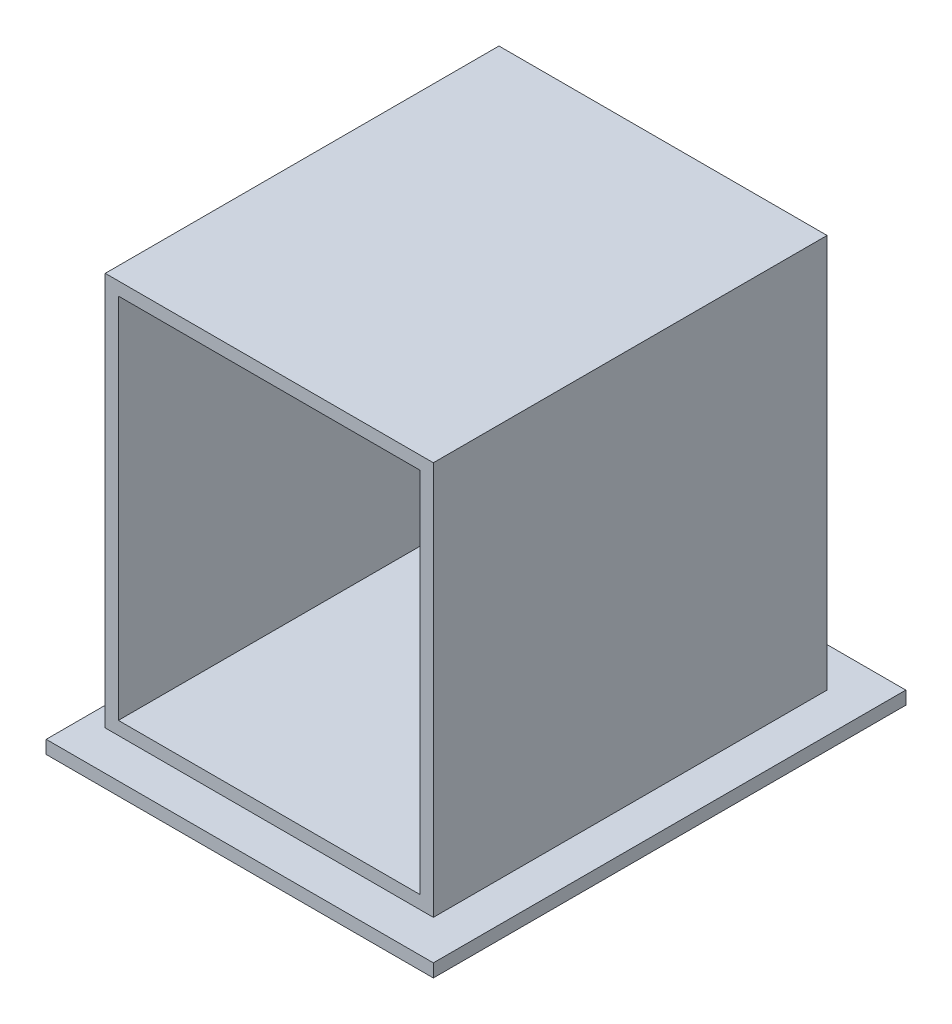
ISO-10303-21;
HEADER;
FILE_DESCRIPTION(('STEP AP214'),'2;1');
FILE_NAME('part.step','',(''),(''),'','','');
FILE_SCHEMA(('AUTOMOTIVE_DESIGN { 1 0 10303 214 1 1 1 1 }'));
ENDSEC;
DATA;
#1=APPLICATION_CONTEXT('core data for automotive mechanical design processes');
#2=APPLICATION_PROTOCOL_DEFINITION('international standard','automotive_design',2000,#1);
#3=PRODUCT_CONTEXT('',#1,'mechanical');
#4=PRODUCT('Part','Part','',(#3));
#5=PRODUCT_RELATED_PRODUCT_CATEGORY('part','',(#4));
#6=PRODUCT_DEFINITION_FORMATION('','',#4);
#7=PRODUCT_DEFINITION_CONTEXT('part definition',#1,'design');
#8=PRODUCT_DEFINITION('design','',#6,#7);
#9=PRODUCT_DEFINITION_SHAPE('','',#8);
#10=(LENGTH_UNIT() NAMED_UNIT(*) SI_UNIT(.MILLI.,.METRE.));
#11=(NAMED_UNIT(*) PLANE_ANGLE_UNIT() SI_UNIT($,.RADIAN.));
#12=(NAMED_UNIT(*) SI_UNIT($,.STERADIAN.) SOLID_ANGLE_UNIT());
#13=UNCERTAINTY_MEASURE_WITH_UNIT(LENGTH_MEASURE(1.E-05),#10,'distance_accuracy_value','');
#14=(GEOMETRIC_REPRESENTATION_CONTEXT(3) GLOBAL_UNCERTAINTY_ASSIGNED_CONTEXT((#13)) GLOBAL_UNIT_ASSIGNED_CONTEXT((#10,
#11,#12)) REPRESENTATION_CONTEXT('',''));
#15=CARTESIAN_POINT('',(0.,0.,0.));
#16=DIRECTION('',(0.,0.,1.));
#17=DIRECTION('',(1.,0.,0.));
#18=AXIS2_PLACEMENT_3D('',#15,#16,#17);
#19=CARTESIAN_POINT('',(0.,0.,300.));
#20=DIRECTION('',(1.,0.,0.));
#21=DIRECTION('',(0.,0.,-1.));
#22=AXIS2_PLACEMENT_3D('',#19,#20,#21);
#23=PLANE('',#22);
#24=DIRECTION('',(0.,-1.,0.));
#25=VECTOR('',#24,1.);
#26=CARTESIAN_POINT('',(0.,0.,0.));
#27=LINE('',#26,#25);
#28=CARTESIAN_POINT('',(0.,300.,0.));
#29=VERTEX_POINT('',#28);
#30=CARTESIAN_POINT('',(0.,0.,0.));
#31=VERTEX_POINT('',#30);
#32=EDGE_CURVE('E238',#29,#31,#27,.T.);
#33=ORIENTED_EDGE('',*,*,#32,.T.);
#34=DIRECTION('',(0.,0.,-1.));
#35=VECTOR('',#34,1.);
#36=CARTESIAN_POINT('',(0.,0.,300.));
#37=LINE('',#36,#35);
#38=CARTESIAN_POINT('',(0.,0.,300.));
#39=VERTEX_POINT('',#38);
#40=EDGE_CURVE('E11',#39,#31,#37,.T.);
#41=ORIENTED_EDGE('',*,*,#40,.F.);
#42=DIRECTION('',(0.,-1.,0.));
#43=VECTOR('',#42,1.);
#44=CARTESIAN_POINT('',(0.,0.,300.));
#45=LINE('',#44,#43);
#46=CARTESIAN_POINT('',(0.,300.,300.));
#47=VERTEX_POINT('',#46);
#48=EDGE_CURVE('E244',#47,#39,#45,.T.);
#49=ORIENTED_EDGE('',*,*,#48,.F.);
#50=DIRECTION('',(0.,0.,-1.));
#51=VECTOR('',#50,1.);
#52=CARTESIAN_POINT('',(0.,300.,300.));
#53=LINE('',#52,#51);
#54=EDGE_CURVE('E253',#47,#29,#53,.T.);
#55=ORIENTED_EDGE('',*,*,#54,.T.);
#56=EDGE_LOOP('',(#33,#41,#49,#55));
#57=FACE_BOUND('',#56,.T.);
#58=ADVANCED_FACE('F33',(#57),#23,.F.);
#59=CARTESIAN_POINT('',(250.,0.,300.));
#60=DIRECTION('',(-1.,0.,0.));
#61=DIRECTION('',(0.,-1.,0.));
#62=AXIS2_PLACEMENT_3D('',#59,#60,#61);
#63=PLANE('',#62);
#64=DIRECTION('',(0.,1.,0.));
#65=VECTOR('',#64,1.);
#66=CARTESIAN_POINT('',(250.,0.,0.));
#67=LINE('',#66,#65);
#68=CARTESIAN_POINT('',(250.,0.,0.));
#69=VERTEX_POINT('',#68);
#70=CARTESIAN_POINT('',(250.,300.,0.));
#71=VERTEX_POINT('',#70);
#72=EDGE_CURVE('E258',#69,#71,#67,.T.);
#73=ORIENTED_EDGE('',*,*,#72,.T.);
#74=DIRECTION('',(0.,0.,-1.));
#75=VECTOR('',#74,1.);
#76=CARTESIAN_POINT('',(250.,300.,300.));
#77=LINE('',#76,#75);
#78=CARTESIAN_POINT('',(250.,300.,300.));
#79=VERTEX_POINT('',#78);
#80=EDGE_CURVE('E263',#79,#71,#77,.T.);
#81=ORIENTED_EDGE('',*,*,#80,.F.);
#82=DIRECTION('',(0.,1.,0.));
#83=VECTOR('',#82,1.);
#84=CARTESIAN_POINT('',(250.,0.,300.));
#85=LINE('',#84,#83);
#86=CARTESIAN_POINT('',(250.,0.,300.));
#87=VERTEX_POINT('',#86);
#88=EDGE_CURVE('E249',#87,#79,#85,.T.);
#89=ORIENTED_EDGE('',*,*,#88,.F.);
#90=DIRECTION('',(0.,0.,-1.));
#91=VECTOR('',#90,1.);
#92=CARTESIAN_POINT('',(250.,0.,300.));
#93=LINE('',#92,#91);
#94=EDGE_CURVE('E40',#87,#69,#93,.T.);
#95=ORIENTED_EDGE('',*,*,#94,.T.);
#96=EDGE_LOOP('',(#73,#81,#89,#95));
#97=FACE_BOUND('',#96,.T.);
#98=ADVANCED_FACE('F269',(#97),#63,.F.);
#99=CARTESIAN_POINT('',(0.,300.,300.));
#100=DIRECTION('',(0.,-1.,0.));
#101=DIRECTION('',(0.,0.,-1.));
#102=AXIS2_PLACEMENT_3D('',#99,#100,#101);
#103=PLANE('',#102);
#104=DIRECTION('',(-1.,0.,0.));
#105=VECTOR('',#104,1.);
#106=CARTESIAN_POINT('',(0.,300.,0.));
#107=LINE('',#106,#105);
#108=EDGE_CURVE('E247',#71,#29,#107,.T.);
#109=ORIENTED_EDGE('',*,*,#108,.T.);
#110=ORIENTED_EDGE('',*,*,#54,.F.);
#111=DIRECTION('',(-1.,0.,0.));
#112=VECTOR('',#111,1.);
#113=CARTESIAN_POINT('',(0.,300.,300.));
#114=LINE('',#113,#112);
#115=EDGE_CURVE('E251',#79,#47,#114,.T.);
#116=ORIENTED_EDGE('',*,*,#115,.F.);
#117=ORIENTED_EDGE('',*,*,#80,.T.);
#118=EDGE_LOOP('',(#109,#110,#116,#117));
#119=FACE_BOUND('',#118,.T.);
#120=ADVANCED_FACE('F285',(#119),#103,.F.);
#121=CARTESIAN_POINT('',(0.,0.,300.));
#122=DIRECTION('',(0.,0.,-1.));
#123=DIRECTION('',(-1.,0.,0.));
#124=AXIS2_PLACEMENT_3D('',#121,#122,#123);
#125=PLANE('',#124);
#126=DIRECTION('',(1.,0.,0.));
#127=VECTOR('',#126,1.);
#128=CARTESIAN_POINT('',(10.,10.,300.));
#129=LINE('',#128,#127);
#130=CARTESIAN_POINT('',(10.,10.,300.));
#131=VERTEX_POINT('',#130);
#132=CARTESIAN_POINT('',(240.,10.,300.));
#133=VERTEX_POINT('',#132);
#134=EDGE_CURVE('E228',#131,#133,#129,.T.);
#135=ORIENTED_EDGE('',*,*,#134,.F.);
#136=DIRECTION('',(0.,-1.,0.));
#137=VECTOR('',#136,1.);
#138=CARTESIAN_POINT('',(10.,10.,300.));
#139=LINE('',#138,#137);
#140=CARTESIAN_POINT('',(10.,290.,300.));
#141=VERTEX_POINT('',#140);
#142=EDGE_CURVE('E55',#141,#131,#139,.T.);
#143=ORIENTED_EDGE('',*,*,#142,.F.);
#144=DIRECTION('',(-1.,0.,0.));
#145=VECTOR('',#144,1.);
#146=CARTESIAN_POINT('',(10.,290.,300.));
#147=LINE('',#146,#145);
#148=CARTESIAN_POINT('',(240.,290.,300.));
#149=VERTEX_POINT('',#148);
#150=EDGE_CURVE('E217',#149,#141,#147,.T.);
#151=ORIENTED_EDGE('',*,*,#150,.F.);
#152=DIRECTION('',(0.,1.,0.));
#153=VECTOR('',#152,1.);
#154=CARTESIAN_POINT('',(240.,10.,300.));
#155=LINE('',#154,#153);
#156=EDGE_CURVE('E231',#133,#149,#155,.T.);
#157=ORIENTED_EDGE('',*,*,#156,.F.);
#158=EDGE_LOOP('',(#135,#143,#151,#157));
#159=FACE_BOUND('',#158,.T.);
#160=ORIENTED_EDGE('',*,*,#48,.T.);
#161=DIRECTION('',(1.,0.,0.));
#162=VECTOR('',#161,1.);
#163=CARTESIAN_POINT('',(0.,0.,300.));
#164=LINE('',#163,#162);
#165=EDGE_CURVE('E246',#39,#87,#164,.T.);
#166=ORIENTED_EDGE('',*,*,#165,.T.);
#167=ORIENTED_EDGE('',*,*,#88,.T.);
#168=ORIENTED_EDGE('',*,*,#115,.T.);
#169=EDGE_LOOP('',(#160,#166,#167,#168));
#170=FACE_BOUND('',#169,.T.);
#171=ADVANCED_FACE('F287',(#159,#170),#125,.F.);
#172=CARTESIAN_POINT('',(0.,0.,0.));
#173=DIRECTION('',(0.,0.,-1.));
#174=DIRECTION('',(-1.,0.,0.));
#175=AXIS2_PLACEMENT_3D('',#172,#173,#174);
#176=PLANE('',#175);
#177=ORIENTED_EDGE('',*,*,#32,.F.);
#178=ORIENTED_EDGE('',*,*,#108,.F.);
#179=ORIENTED_EDGE('',*,*,#72,.F.);
#180=DIRECTION('',(1.,0.,0.));
#181=VECTOR('',#180,1.);
#182=CARTESIAN_POINT('',(0.,0.,0.));
#183=LINE('',#182,#181);
#184=EDGE_CURVE('E255',#31,#69,#183,.T.);
#185=ORIENTED_EDGE('',*,*,#184,.F.);
#186=EDGE_LOOP('',(#177,#178,#179,#185));
#187=FACE_BOUND('',#186,.T.);
#188=ADVANCED_FACE('F277',(#187),#176,.T.);
#189=CARTESIAN_POINT('',(10.,10.,10.));
#190=DIRECTION('',(-1.,0.,0.));
#191=DIRECTION('',(0.,-1.,0.));
#192=AXIS2_PLACEMENT_3D('',#189,#190,#191);
#193=PLANE('',#192);
#194=ORIENTED_EDGE('',*,*,#142,.T.);
#195=DIRECTION('',(0.,0.,1.));
#196=VECTOR('',#195,1.);
#197=CARTESIAN_POINT('',(10.,10.,10.));
#198=LINE('',#197,#196);
#199=CARTESIAN_POINT('',(10.,10.,10.));
#200=VERTEX_POINT('',#199);
#201=EDGE_CURVE('E226',#200,#131,#198,.T.);
#202=ORIENTED_EDGE('',*,*,#201,.F.);
#203=DIRECTION('',(0.,-1.,0.));
#204=VECTOR('',#203,1.);
#205=CARTESIAN_POINT('',(10.,10.,10.));
#206=LINE('',#205,#204);
#207=CARTESIAN_POINT('',(10.,290.,10.));
#208=VERTEX_POINT('',#207);
#209=EDGE_CURVE('E213',#208,#200,#206,.T.);
#210=ORIENTED_EDGE('',*,*,#209,.F.);
#211=DIRECTION('',(0.,0.,1.));
#212=VECTOR('',#211,1.);
#213=CARTESIAN_POINT('',(10.,290.,10.));
#214=LINE('',#213,#212);
#215=EDGE_CURVE('E236',#208,#141,#214,.T.);
#216=ORIENTED_EDGE('',*,*,#215,.T.);
#217=EDGE_LOOP('',(#194,#202,#210,#216));
#218=FACE_BOUND('',#217,.T.);
#219=ADVANCED_FACE('F295',(#218),#193,.F.);
#220=CARTESIAN_POINT('',(10.,290.,10.));
#221=DIRECTION('',(0.,1.,0.));
#222=DIRECTION('',(0.,0.,1.));
#223=AXIS2_PLACEMENT_3D('',#220,#221,#222);
#224=PLANE('',#223);
#225=ORIENTED_EDGE('',*,*,#150,.T.);
#226=ORIENTED_EDGE('',*,*,#215,.F.);
#227=DIRECTION('',(-1.,0.,0.));
#228=VECTOR('',#227,1.);
#229=CARTESIAN_POINT('',(10.,290.,10.));
#230=LINE('',#229,#228);
#231=CARTESIAN_POINT('',(240.,290.,10.));
#232=VERTEX_POINT('',#231);
#233=EDGE_CURVE('E223',#232,#208,#230,.T.);
#234=ORIENTED_EDGE('',*,*,#233,.F.);
#235=DIRECTION('',(0.,0.,1.));
#236=VECTOR('',#235,1.);
#237=CARTESIAN_POINT('',(240.,290.,10.));
#238=LINE('',#237,#236);
#239=EDGE_CURVE('E239',#232,#149,#238,.T.);
#240=ORIENTED_EDGE('',*,*,#239,.T.);
#241=EDGE_LOOP('',(#225,#226,#234,#240));
#242=FACE_BOUND('',#241,.T.);
#243=ADVANCED_FACE('F333',(#242),#224,.F.);
#244=CARTESIAN_POINT('',(240.,10.,10.));
#245=DIRECTION('',(1.,0.,0.));
#246=DIRECTION('',(0.,0.,-1.));
#247=AXIS2_PLACEMENT_3D('',#244,#245,#246);
#248=PLANE('',#247);
#249=ORIENTED_EDGE('',*,*,#156,.T.);
#250=ORIENTED_EDGE('',*,*,#239,.F.);
#251=DIRECTION('',(0.,1.,0.));
#252=VECTOR('',#251,1.);
#253=CARTESIAN_POINT('',(240.,10.,10.));
#254=LINE('',#253,#252);
#255=CARTESIAN_POINT('',(240.,10.,10.));
#256=VERTEX_POINT('',#255);
#257=EDGE_CURVE('E220',#256,#232,#254,.T.);
#258=ORIENTED_EDGE('',*,*,#257,.F.);
#259=DIRECTION('',(0.,0.,1.));
#260=VECTOR('',#259,1.);
#261=CARTESIAN_POINT('',(240.,10.,10.));
#262=LINE('',#261,#260);
#263=EDGE_CURVE('E241',#256,#133,#262,.T.);
#264=ORIENTED_EDGE('',*,*,#263,.T.);
#265=EDGE_LOOP('',(#249,#250,#258,#264));
#266=FACE_BOUND('',#265,.T.);
#267=ADVANCED_FACE('F338',(#266),#248,.F.);
#268=CARTESIAN_POINT('',(10.,10.,10.));
#269=DIRECTION('',(0.,-1.,0.));
#270=DIRECTION('',(0.,0.,-1.));
#271=AXIS2_PLACEMENT_3D('',#268,#269,#270);
#272=PLANE('',#271);
#273=ORIENTED_EDGE('',*,*,#134,.T.);
#274=ORIENTED_EDGE('',*,*,#263,.F.);
#275=DIRECTION('',(1.,0.,0.));
#276=VECTOR('',#275,1.);
#277=CARTESIAN_POINT('',(10.,10.,10.));
#278=LINE('',#277,#276);
#279=EDGE_CURVE('E216',#200,#256,#278,.T.);
#280=ORIENTED_EDGE('',*,*,#279,.F.);
#281=ORIENTED_EDGE('',*,*,#201,.T.);
#282=EDGE_LOOP('',(#273,#274,#280,#281));
#283=FACE_BOUND('',#282,.T.);
#284=ADVANCED_FACE('F346',(#283),#272,.F.);
#285=CARTESIAN_POINT('',(0.,0.,10.));
#286=DIRECTION('',(0.,0.,-1.));
#287=DIRECTION('',(-1.,0.,0.));
#288=AXIS2_PLACEMENT_3D('',#285,#286,#287);
#289=PLANE('',#288);
#290=ORIENTED_EDGE('',*,*,#209,.T.);
#291=ORIENTED_EDGE('',*,*,#279,.T.);
#292=ORIENTED_EDGE('',*,*,#257,.T.);
#293=ORIENTED_EDGE('',*,*,#233,.T.);
#294=EDGE_LOOP('',(#290,#291,#292,#293));
#295=FACE_BOUND('',#294,.T.);
#296=ADVANCED_FACE('F354',(#295),#289,.F.);
#297=CARTESIAN_POINT('',(0.,0.,0.));
#298=DIRECTION('',(0.,-1.,0.));
#299=DIRECTION('',(0.,0.,-1.));
#300=AXIS2_PLACEMENT_3D('',#297,#298,#299);
#301=PLANE('',#300);
#302=DIRECTION('',(0.,0.,-1.));
#303=VECTOR('',#302,1.);
#304=CARTESIAN_POINT('',(-15.,0.,330.));
#305=LINE('',#304,#303);
#306=CARTESIAN_POINT('',(-15.,0.,330.));
#307=VERTEX_POINT('',#306);
#308=CARTESIAN_POINT('',(-15.,0.,-30.));
#309=VERTEX_POINT('',#308);
#310=EDGE_CURVE('E180',#307,#309,#305,.T.);
#311=ORIENTED_EDGE('',*,*,#310,.F.);
#312=DIRECTION('',(-1.,0.,0.));
#313=VECTOR('',#312,1.);
#314=CARTESIAN_POINT('',(-15.,0.,330.));
#315=LINE('',#314,#313);
#316=CARTESIAN_POINT('',(280.,0.,330.));
#317=VERTEX_POINT('',#316);
#318=EDGE_CURVE('E188',#317,#307,#315,.T.);
#319=ORIENTED_EDGE('',*,*,#318,.F.);
#320=DIRECTION('',(0.,0.,1.));
#321=VECTOR('',#320,1.);
#322=CARTESIAN_POINT('',(280.,0.,330.));
#323=LINE('',#322,#321);
#324=CARTESIAN_POINT('',(280.,0.,-30.));
#325=VERTEX_POINT('',#324);
#326=EDGE_CURVE('E199',#325,#317,#323,.T.);
#327=ORIENTED_EDGE('',*,*,#326,.F.);
#328=DIRECTION('',(1.,0.,0.));
#329=VECTOR('',#328,1.);
#330=CARTESIAN_POINT('',(-15.,0.,-30.));
#331=LINE('',#330,#329);
#332=EDGE_CURVE('E197',#309,#325,#331,.T.);
#333=ORIENTED_EDGE('',*,*,#332,.F.);
#334=EDGE_LOOP('',(#311,#319,#327,#333));
#335=FACE_BOUND('',#334,.T.);
#336=ORIENTED_EDGE('',*,*,#40,.T.);
#337=ORIENTED_EDGE('',*,*,#184,.T.);
#338=ORIENTED_EDGE('',*,*,#94,.F.);
#339=ORIENTED_EDGE('',*,*,#165,.F.);
#340=EDGE_LOOP('',(#336,#337,#338,#339));
#341=FACE_BOUND('',#340,.T.);
#342=ADVANCED_FACE('F278',(#335,#341),#301,.F.);
#343=CARTESIAN_POINT('',(-15.,-10.,330.));
#344=DIRECTION('',(1.,0.,0.));
#345=DIRECTION('',(0.,0.,-1.));
#346=AXIS2_PLACEMENT_3D('',#343,#344,#345);
#347=PLANE('',#346);
#348=ORIENTED_EDGE('',*,*,#310,.T.);
#349=DIRECTION('',(0.,1.,0.));
#350=VECTOR('',#349,1.);
#351=CARTESIAN_POINT('',(-15.,-10.,-30.));
#352=LINE('',#351,#350);
#353=CARTESIAN_POINT('',(-15.,-10.,-30.));
#354=VERTEX_POINT('',#353);
#355=EDGE_CURVE('E210',#354,#309,#352,.T.);
#356=ORIENTED_EDGE('',*,*,#355,.F.);
#357=DIRECTION('',(0.,0.,-1.));
#358=VECTOR('',#357,1.);
#359=CARTESIAN_POINT('',(-15.,-10.,330.));
#360=LINE('',#359,#358);
#361=CARTESIAN_POINT('',(-15.,-10.,330.));
#362=VERTEX_POINT('',#361);
#363=EDGE_CURVE('E184',#362,#354,#360,.T.);
#364=ORIENTED_EDGE('',*,*,#363,.F.);
#365=DIRECTION('',(0.,1.,0.));
#366=VECTOR('',#365,1.);
#367=CARTESIAN_POINT('',(-15.,-10.,330.));
#368=LINE('',#367,#366);
#369=EDGE_CURVE('E194',#362,#307,#368,.T.);
#370=ORIENTED_EDGE('',*,*,#369,.T.);
#371=EDGE_LOOP('',(#348,#356,#364,#370));
#372=FACE_BOUND('',#371,.T.);
#373=ADVANCED_FACE('F367',(#372),#347,.F.);
#374=CARTESIAN_POINT('',(-15.,-10.,-30.));
#375=DIRECTION('',(0.,0.,1.));
#376=DIRECTION('',(1.,0.,0.));
#377=AXIS2_PLACEMENT_3D('',#374,#375,#376);
#378=PLANE('',#377);
#379=ORIENTED_EDGE('',*,*,#332,.T.);
#380=DIRECTION('',(0.,1.,0.));
#381=VECTOR('',#380,1.);
#382=CARTESIAN_POINT('',(280.,-10.,-30.));
#383=LINE('',#382,#381);
#384=CARTESIAN_POINT('',(280.,-10.,-30.));
#385=VERTEX_POINT('',#384);
#386=EDGE_CURVE('E207',#385,#325,#383,.T.);
#387=ORIENTED_EDGE('',*,*,#386,.F.);
#388=DIRECTION('',(1.,0.,0.));
#389=VECTOR('',#388,1.);
#390=CARTESIAN_POINT('',(-15.,-10.,-30.));
#391=LINE('',#390,#389);
#392=EDGE_CURVE('E187',#354,#385,#391,.T.);
#393=ORIENTED_EDGE('',*,*,#392,.F.);
#394=ORIENTED_EDGE('',*,*,#355,.T.);
#395=EDGE_LOOP('',(#379,#387,#393,#394));
#396=FACE_BOUND('',#395,.T.);
#397=ADVANCED_FACE('F375',(#396),#378,.F.);
#398=CARTESIAN_POINT('',(280.,-10.,330.));
#399=DIRECTION('',(-1.,0.,0.));
#400=DIRECTION('',(0.,0.,1.));
#401=AXIS2_PLACEMENT_3D('',#398,#399,#400);
#402=PLANE('',#401);
#403=ORIENTED_EDGE('',*,*,#326,.T.);
#404=DIRECTION('',(0.,1.,0.));
#405=VECTOR('',#404,1.);
#406=CARTESIAN_POINT('',(280.,-10.,330.));
#407=LINE('',#406,#405);
#408=CARTESIAN_POINT('',(280.,-10.,330.));
#409=VERTEX_POINT('',#408);
#410=EDGE_CURVE('E204',#409,#317,#407,.T.);
#411=ORIENTED_EDGE('',*,*,#410,.F.);
#412=DIRECTION('',(0.,0.,1.));
#413=VECTOR('',#412,1.);
#414=CARTESIAN_POINT('',(280.,-10.,330.));
#415=LINE('',#414,#413);
#416=EDGE_CURVE('E190',#385,#409,#415,.T.);
#417=ORIENTED_EDGE('',*,*,#416,.F.);
#418=ORIENTED_EDGE('',*,*,#386,.T.);
#419=EDGE_LOOP('',(#403,#411,#417,#418));
#420=FACE_BOUND('',#419,.T.);
#421=ADVANCED_FACE('F383',(#420),#402,.F.);
#422=CARTESIAN_POINT('',(-15.,-10.,330.));
#423=DIRECTION('',(0.,0.,-1.));
#424=DIRECTION('',(-1.,0.,0.));
#425=AXIS2_PLACEMENT_3D('',#422,#423,#424);
#426=PLANE('',#425);
#427=ORIENTED_EDGE('',*,*,#318,.T.);
#428=ORIENTED_EDGE('',*,*,#369,.F.);
#429=DIRECTION('',(-1.,0.,0.));
#430=VECTOR('',#429,1.);
#431=CARTESIAN_POINT('',(-15.,-10.,330.));
#432=LINE('',#431,#430);
#433=EDGE_CURVE('E192',#409,#362,#432,.T.);
#434=ORIENTED_EDGE('',*,*,#433,.F.);
#435=ORIENTED_EDGE('',*,*,#410,.T.);
#436=EDGE_LOOP('',(#427,#428,#434,#435));
#437=FACE_BOUND('',#436,.T.);
#438=ADVANCED_FACE('F391',(#437),#426,.F.);
#439=CARTESIAN_POINT('',(0.,-10.,0.));
#440=DIRECTION('',(0.,-1.,0.));
#441=DIRECTION('',(0.,0.,-1.));
#442=AXIS2_PLACEMENT_3D('',#439,#440,#441);
#443=PLANE('',#442);
#444=CARTESIAN_POINT('',(101.811483312725,-10.,270.));
#445=DIRECTION('',(0.,-1.,0.));
#446=DIRECTION('',(0.,0.,-1.));
#447=AXIS2_PLACEMENT_3D('',#444,#445,#446);
#448=CIRCLE('',#447,17.7380716413183);
#449=CARTESIAN_POINT('',(101.811483312725,-10.,287.738071641318));
#450=VERTEX_POINT('',#449);
#451=CARTESIAN_POINT('',(101.811483312725,-10.,252.261928358682));
#452=VERTEX_POINT('',#451);
#453=EDGE_CURVE('E47',#450,#452,#448,.T.);
#454=ORIENTED_EDGE('',*,*,#453,.F.);
#455=DIRECTION('',(-1.,0.,0.));
#456=VECTOR('',#455,1.);
#457=CARTESIAN_POINT('',(101.811483312725,-10.,287.738071641318));
#458=LINE('',#457,#456);
#459=CARTESIAN_POINT('',(183.649909722691,-10.,287.738071641318));
#460=VERTEX_POINT('',#459);
#461=EDGE_CURVE('E165',#460,#450,#458,.T.);
#462=ORIENTED_EDGE('',*,*,#461,.F.);
#463=CARTESIAN_POINT('',(183.649909722691,-10.,270.));
#464=DIRECTION('',(0.,-1.,0.));
#465=DIRECTION('',(0.,0.,-1.));
#466=AXIS2_PLACEMENT_3D('',#463,#464,#465);
#467=CIRCLE('',#466,17.7380716413183);
#468=CARTESIAN_POINT('',(183.649909722691,-10.,252.261928358682));
#469=VERTEX_POINT('',#468);
#470=EDGE_CURVE('E168',#469,#460,#467,.T.);
#471=ORIENTED_EDGE('',*,*,#470,.F.);
#472=DIRECTION('',(1.,0.,0.));
#473=VECTOR('',#472,1.);
#474=CARTESIAN_POINT('',(101.811483312725,-10.,252.261928358682));
#475=LINE('',#474,#473);
#476=EDGE_CURVE('E174',#452,#469,#475,.T.);
#477=ORIENTED_EDGE('',*,*,#476,.F.);
#478=EDGE_LOOP('',(#454,#462,#471,#477));
#479=FACE_BOUND('',#478,.T.);
#480=ORIENTED_EDGE('',*,*,#363,.T.);
#481=ORIENTED_EDGE('',*,*,#392,.T.);
#482=ORIENTED_EDGE('',*,*,#416,.T.);
#483=ORIENTED_EDGE('',*,*,#433,.T.);
#484=EDGE_LOOP('',(#480,#481,#482,#483));
#485=FACE_BOUND('',#484,.T.);
#486=ADVANCED_FACE('F399',(#479,#485),#443,.T.);
#487=CARTESIAN_POINT('',(101.811483312725,0.,270.));
#488=DIRECTION('',(0.,-1.,0.));
#489=DIRECTION('',(0.,0.,-1.));
#490=AXIS2_PLACEMENT_3D('',#487,#488,#489);
#491=CYLINDRICAL_SURFACE('',#490,17.7380716413183);
#492=ORIENTED_EDGE('',*,*,#453,.T.);
#493=DIRECTION('',(0.,-1.,0.));
#494=VECTOR('',#493,1.);
#495=CARTESIAN_POINT('',(101.811483312725,0.,252.261928358682));
#496=LINE('',#495,#494);
#497=CARTESIAN_POINT('',(101.811483312725,0.,252.261928358682));
#498=VERTEX_POINT('',#497);
#499=EDGE_CURVE('E143',#498,#452,#496,.T.);
#500=ORIENTED_EDGE('',*,*,#499,.F.);
#501=CARTESIAN_POINT('',(101.811483312725,0.,270.));
#502=DIRECTION('',(0.,-1.,0.));
#503=DIRECTION('',(0.,0.,-1.));
#504=AXIS2_PLACEMENT_3D('',#501,#502,#503);
#505=CIRCLE('',#504,17.7380716413183);
#506=CARTESIAN_POINT('',(101.811483312725,0.,287.738071641318));
#507=VERTEX_POINT('',#506);
#508=EDGE_CURVE('E147',#507,#498,#505,.T.);
#509=ORIENTED_EDGE('',*,*,#508,.F.);
#510=DIRECTION('',(0.,-1.,0.));
#511=VECTOR('',#510,1.);
#512=CARTESIAN_POINT('',(101.811483312725,0.,287.738071641318));
#513=LINE('',#512,#511);
#514=EDGE_CURVE('E178',#507,#450,#513,.T.);
#515=ORIENTED_EDGE('',*,*,#514,.T.);
#516=EDGE_LOOP('',(#492,#500,#509,#515));
#517=FACE_BOUND('',#516,.T.);
#518=ADVANCED_FACE('F145',(#517),#491,.F.);
#519=CARTESIAN_POINT('',(101.811483312725,0.,287.738071641318));
#520=DIRECTION('',(0.,0.,1.));
#521=DIRECTION('',(1.,0.,0.));
#522=AXIS2_PLACEMENT_3D('',#519,#520,#521);
#523=PLANE('',#522);
#524=ORIENTED_EDGE('',*,*,#461,.T.);
#525=ORIENTED_EDGE('',*,*,#514,.F.);
#526=DIRECTION('',(-1.,0.,0.));
#527=VECTOR('',#526,1.);
#528=CARTESIAN_POINT('',(101.811483312725,0.,287.738071641318));
#529=LINE('',#528,#527);
#530=CARTESIAN_POINT('',(183.649909722691,0.,287.738071641318));
#531=VERTEX_POINT('',#530);
#532=EDGE_CURVE('E153',#531,#507,#529,.T.);
#533=ORIENTED_EDGE('',*,*,#532,.F.);
#534=DIRECTION('',(0.,-1.,0.));
#535=VECTOR('',#534,1.);
#536=CARTESIAN_POINT('',(183.649909722691,0.,287.738071641318));
#537=LINE('',#536,#535);
#538=EDGE_CURVE('E181',#531,#460,#537,.T.);
#539=ORIENTED_EDGE('',*,*,#538,.T.);
#540=EDGE_LOOP('',(#524,#525,#533,#539));
#541=FACE_BOUND('',#540,.T.);
#542=ADVANCED_FACE('F417',(#541),#523,.F.);
#543=CARTESIAN_POINT('',(183.649909722691,0.,270.));
#544=DIRECTION('',(0.,-1.,0.));
#545=DIRECTION('',(0.,0.,-1.));
#546=AXIS2_PLACEMENT_3D('',#543,#544,#545);
#547=CYLINDRICAL_SURFACE('',#546,17.7380716413183);
#548=ORIENTED_EDGE('',*,*,#470,.T.);
#549=ORIENTED_EDGE('',*,*,#538,.F.);
#550=CARTESIAN_POINT('',(183.649909722691,0.,270.));
#551=DIRECTION('',(0.,-1.,0.));
#552=DIRECTION('',(0.,0.,-1.));
#553=AXIS2_PLACEMENT_3D('',#550,#551,#552);
#554=CIRCLE('',#553,17.7380716413183);
#555=CARTESIAN_POINT('',(183.649909722691,0.,252.261928358682));
#556=VERTEX_POINT('',#555);
#557=EDGE_CURVE('E161',#556,#531,#554,.T.);
#558=ORIENTED_EDGE('',*,*,#557,.F.);
#559=DIRECTION('',(0.,-1.,0.));
#560=VECTOR('',#559,1.);
#561=CARTESIAN_POINT('',(183.649909722691,0.,252.261928358682));
#562=LINE('',#561,#560);
#563=EDGE_CURVE('E152',#556,#469,#562,.T.);
#564=ORIENTED_EDGE('',*,*,#563,.T.);
#565=EDGE_LOOP('',(#548,#549,#558,#564));
#566=FACE_BOUND('',#565,.T.);
#567=ADVANCED_FACE('F423',(#566),#547,.F.);
#568=CARTESIAN_POINT('',(101.811483312725,0.,252.261928358682));
#569=DIRECTION('',(0.,0.,-1.));
#570=DIRECTION('',(-1.,0.,0.));
#571=AXIS2_PLACEMENT_3D('',#568,#569,#570);
#572=PLANE('',#571);
#573=ORIENTED_EDGE('',*,*,#476,.T.);
#574=ORIENTED_EDGE('',*,*,#563,.F.);
#575=DIRECTION('',(1.,0.,0.));
#576=VECTOR('',#575,1.);
#577=CARTESIAN_POINT('',(101.811483312725,0.,252.261928358682));
#578=LINE('',#577,#576);
#579=EDGE_CURVE('E156',#498,#556,#578,.T.);
#580=ORIENTED_EDGE('',*,*,#579,.F.);
#581=ORIENTED_EDGE('',*,*,#499,.T.);
#582=EDGE_LOOP('',(#573,#574,#580,#581));
#583=FACE_BOUND('',#582,.T.);
#584=ADVANCED_FACE('F157',(#583),#572,.F.);
#585=CARTESIAN_POINT('',(101.811483312725,0.,270.));
#586=DIRECTION('',(0.,-1.,0.));
#587=DIRECTION('',(0.,0.,-1.));
#588=AXIS2_PLACEMENT_3D('',#585,#586,#587);
#589=PLANE('',#588);
#590=ORIENTED_EDGE('',*,*,#508,.T.);
#591=ORIENTED_EDGE('',*,*,#579,.T.);
#592=ORIENTED_EDGE('',*,*,#557,.T.);
#593=ORIENTED_EDGE('',*,*,#532,.T.);
#594=EDGE_LOOP('',(#590,#591,#592,#593));
#595=FACE_BOUND('',#594,.T.);
#596=ADVANCED_FACE('F163',(#595),#589,.T.);
#597=CLOSED_SHELL('',(#58,#98,#120,#171,#188,#219,#243,#267,#284,#296,#342,#373,#397,#421,#438,
#486,#518,#542,#567,#584,#596));
#598=MANIFOLD_SOLID_BREP('B2',#597);
#599=ADVANCED_BREP_SHAPE_REPRESENTATION('',(#18,#598),#14);
#600=SHAPE_DEFINITION_REPRESENTATION(#9,#599);
ENDSEC;
END-ISO-10303-21;
